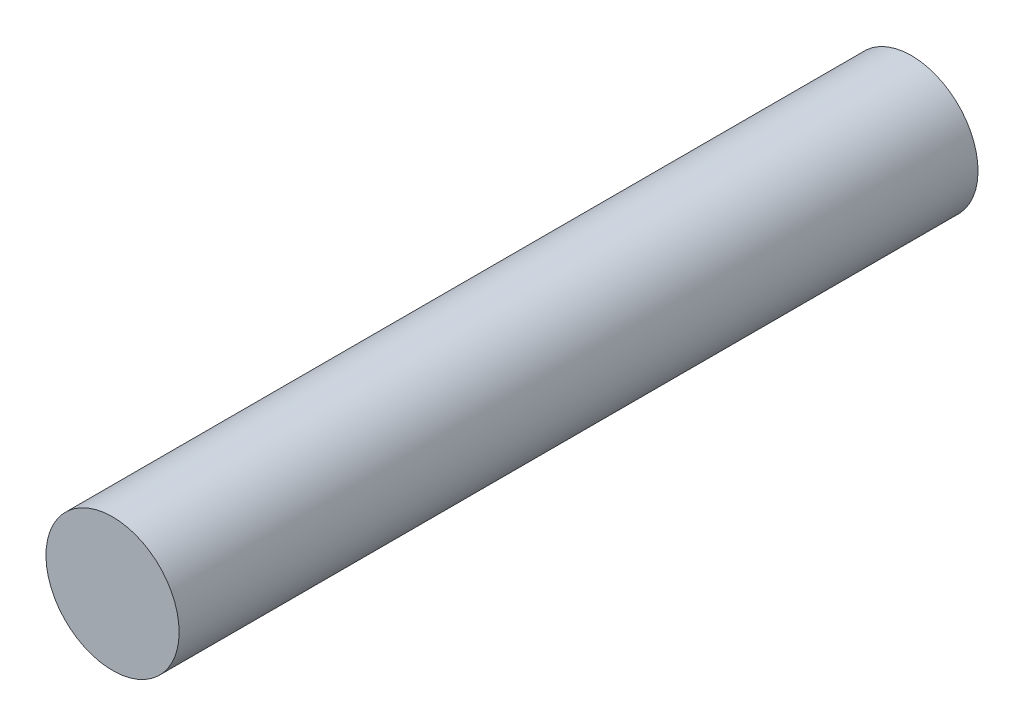
ISO-10303-21;
HEADER;
FILE_DESCRIPTION(('STEP AP214'),'2;1');
FILE_NAME('part.step','',(''),(''),'','','');
FILE_SCHEMA(('AUTOMOTIVE_DESIGN { 1 0 10303 214 1 1 1 1 }'));
ENDSEC;
DATA;
#1=APPLICATION_CONTEXT('core data for automotive mechanical design processes');
#2=APPLICATION_PROTOCOL_DEFINITION('international standard','automotive_design',2000,#1);
#3=PRODUCT_CONTEXT('',#1,'mechanical');
#4=PRODUCT('Part','Part','',(#3));
#5=PRODUCT_RELATED_PRODUCT_CATEGORY('part','',(#4));
#6=PRODUCT_DEFINITION_FORMATION('','',#4);
#7=PRODUCT_DEFINITION_CONTEXT('part definition',#1,'design');
#8=PRODUCT_DEFINITION('design','',#6,#7);
#9=PRODUCT_DEFINITION_SHAPE('','',#8);
#10=(LENGTH_UNIT() NAMED_UNIT(*) SI_UNIT(.MILLI.,.METRE.));
#11=(NAMED_UNIT(*) PLANE_ANGLE_UNIT() SI_UNIT($,.RADIAN.));
#12=(NAMED_UNIT(*) SI_UNIT($,.STERADIAN.) SOLID_ANGLE_UNIT());
#13=UNCERTAINTY_MEASURE_WITH_UNIT(LENGTH_MEASURE(1.E-05),#10,'distance_accuracy_value','');
#14=(GEOMETRIC_REPRESENTATION_CONTEXT(3) GLOBAL_UNCERTAINTY_ASSIGNED_CONTEXT((#13)) GLOBAL_UNIT_ASSIGNED_CONTEXT((#10,
#11,#12)) REPRESENTATION_CONTEXT('',''));
#15=CARTESIAN_POINT('',(0.,0.,0.));
#16=DIRECTION('',(0.,0.,1.));
#17=DIRECTION('',(1.,0.,0.));
#18=AXIS2_PLACEMENT_3D('',#15,#16,#17);
#19=CARTESIAN_POINT('',(0.,0.,15.));
#20=DIRECTION('',(0.,0.,-1.));
#21=DIRECTION('',(-1.,0.,0.));
#22=AXIS2_PLACEMENT_3D('',#19,#20,#21);
#23=CYLINDRICAL_SURFACE('',#22,2.5);
#24=CARTESIAN_POINT('',(0.,0.,15.));
#25=DIRECTION('',(0.,0.,1.));
#26=DIRECTION('',(1.,0.,0.));
#27=AXIS2_PLACEMENT_3D('',#24,#25,#26);
#28=CIRCLE('',#27,2.5);
#29=CARTESIAN_POINT('',(2.5,0.,15.));
#30=VERTEX_POINT('',#29);
#31=EDGE_CURVE('E13',#30,#30,#28,.T.);
#32=ORIENTED_EDGE('',*,*,#31,.F.);
#33=EDGE_LOOP('',(#32));
#34=FACE_BOUND('',#33,.T.);
#35=CARTESIAN_POINT('',(0.,1.06251812903579E-13,-5.));
#36=DIRECTION('',(0.,0.,-1.));
#37=DIRECTION('',(1.,0.,0.));
#38=AXIS2_PLACEMENT_3D('',#35,#36,#37);
#39=CIRCLE('',#38,2.5000000000001);
#40=CARTESIAN_POINT('',(0.5,-2.44948974278318,-5.));
#41=VERTEX_POINT('',#40);
#42=CARTESIAN_POINT('',(-0.5,-2.44948974278318,-5.));
#43=VERTEX_POINT('',#42);
#44=EDGE_CURVE('E108',#41,#43,#39,.T.);
#45=ORIENTED_EDGE('',*,*,#44,.F.);
#46=DIRECTION('',(0.,0.,-1.));
#47=VECTOR('',#46,1.);
#48=CARTESIAN_POINT('',(0.5,-2.44948974278318,-5.));
#49=LINE('',#48,#47);
#50=CARTESIAN_POINT('',(0.5,-2.44948974278318,-15.));
#51=VERTEX_POINT('',#50);
#52=EDGE_CURVE('E70',#41,#51,#49,.T.);
#53=ORIENTED_EDGE('',*,*,#52,.T.);
#54=CARTESIAN_POINT('',(0.,0.,-15.));
#55=DIRECTION('',(0.,0.,1.));
#56=DIRECTION('',(1.,0.,0.));
#57=AXIS2_PLACEMENT_3D('',#54,#55,#56);
#58=CIRCLE('',#57,2.5);
#59=CARTESIAN_POINT('',(-0.5,-2.44948974278318,-15.));
#60=VERTEX_POINT('',#59);
#61=EDGE_CURVE('E50',#51,#60,#58,.T.);
#62=ORIENTED_EDGE('',*,*,#61,.T.);
#63=DIRECTION('',(0.,0.,-1.));
#64=VECTOR('',#63,1.);
#65=CARTESIAN_POINT('',(-0.5,-2.44948974278318,-5.));
#66=LINE('',#65,#64);
#67=EDGE_CURVE('E61',#43,#60,#66,.T.);
#68=ORIENTED_EDGE('',*,*,#67,.F.);
#69=EDGE_LOOP('',(#45,#53,#62,#68));
#70=FACE_BOUND('',#69,.T.);
#71=ADVANCED_FACE('F47',(#34,#70),#23,.T.);
#72=CARTESIAN_POINT('',(0.,0.,15.));
#73=DIRECTION('',(0.,0.,1.));
#74=DIRECTION('',(1.,0.,0.));
#75=AXIS2_PLACEMENT_3D('',#72,#73,#74);
#76=PLANE('',#75);
#77=ORIENTED_EDGE('',*,*,#31,.T.);
#78=EDGE_LOOP('',(#77));
#79=FACE_BOUND('',#78,.T.);
#80=ADVANCED_FACE('F126',(#79),#76,.T.);
#81=CARTESIAN_POINT('',(0.,0.,-15.));
#82=DIRECTION('',(0.,0.,1.));
#83=DIRECTION('',(1.,0.,0.));
#84=AXIS2_PLACEMENT_3D('',#81,#82,#83);
#85=PLANE('',#84);
#86=ORIENTED_EDGE('',*,*,#61,.F.);
#87=DIRECTION('',(0.,-1.,0.));
#88=VECTOR('',#87,1.);
#89=CARTESIAN_POINT('',(0.5,-2.44948974278318,-15.));
#90=LINE('',#89,#88);
#91=CARTESIAN_POINT('',(0.5,-1.94948974278318,-15.));
#92=VERTEX_POINT('',#91);
#93=EDGE_CURVE('E85',#92,#51,#90,.T.);
#94=ORIENTED_EDGE('',*,*,#93,.F.);
#95=DIRECTION('',(1.,0.,0.));
#96=VECTOR('',#95,1.);
#97=CARTESIAN_POINT('',(0.5,-1.94948974278318,-15.));
#98=LINE('',#97,#96);
#99=CARTESIAN_POINT('',(-0.5,-1.94948974278318,-15.));
#100=VERTEX_POINT('',#99);
#101=EDGE_CURVE('E114',#100,#92,#98,.T.);
#102=ORIENTED_EDGE('',*,*,#101,.F.);
#103=DIRECTION('',(0.,1.,0.));
#104=VECTOR('',#103,1.);
#105=CARTESIAN_POINT('',(-0.5,-1.94948974278318,-15.));
#106=LINE('',#105,#104);
#107=EDGE_CURVE('E94',#60,#100,#106,.T.);
#108=ORIENTED_EDGE('',*,*,#107,.F.);
#109=EDGE_LOOP('',(#86,#94,#102,#108));
#110=FACE_BOUND('',#109,.T.);
#111=ADVANCED_FACE('F122',(#110),#85,.F.);
#112=CARTESIAN_POINT('',(0.5,-2.44948974278318,-5.));
#113=DIRECTION('',(1.,0.,0.));
#114=DIRECTION('',(0.,0.,-1.));
#115=AXIS2_PLACEMENT_3D('',#112,#113,#114);
#116=PLANE('',#115);
#117=ORIENTED_EDGE('',*,*,#93,.T.);
#118=ORIENTED_EDGE('',*,*,#52,.F.);
#119=DIRECTION('',(0.,-1.,0.));
#120=VECTOR('',#119,1.);
#121=CARTESIAN_POINT('',(0.5,-2.44948974278318,-5.));
#122=LINE('',#121,#120);
#123=CARTESIAN_POINT('',(0.5,-1.94948974278318,-5.));
#124=VERTEX_POINT('',#123);
#125=EDGE_CURVE('E104',#124,#41,#122,.T.);
#126=ORIENTED_EDGE('',*,*,#125,.F.);
#127=DIRECTION('',(0.,0.,-1.));
#128=VECTOR('',#127,1.);
#129=CARTESIAN_POINT('',(0.5,-1.94948974278318,-5.));
#130=LINE('',#129,#128);
#131=EDGE_CURVE('E98',#124,#92,#130,.T.);
#132=ORIENTED_EDGE('',*,*,#131,.T.);
#133=EDGE_LOOP('',(#117,#118,#126,#132));
#134=FACE_BOUND('',#133,.T.);
#135=ADVANCED_FACE('F119',(#134),#116,.F.);
#136=CARTESIAN_POINT('',(0.5,-1.94948974278318,-5.));
#137=DIRECTION('',(0.,1.,0.));
#138=DIRECTION('',(0.,0.,1.));
#139=AXIS2_PLACEMENT_3D('',#136,#137,#138);
#140=PLANE('',#139);
#141=ORIENTED_EDGE('',*,*,#101,.T.);
#142=ORIENTED_EDGE('',*,*,#131,.F.);
#143=DIRECTION('',(1.,0.,0.));
#144=VECTOR('',#143,1.);
#145=CARTESIAN_POINT('',(0.5,-1.94948974278318,-5.));
#146=LINE('',#145,#144);
#147=CARTESIAN_POINT('',(-0.5,-1.94948974278318,-5.));
#148=VERTEX_POINT('',#147);
#149=EDGE_CURVE('E101',#148,#124,#146,.T.);
#150=ORIENTED_EDGE('',*,*,#149,.F.);
#151=DIRECTION('',(0.,0.,-1.));
#152=VECTOR('',#151,1.);
#153=CARTESIAN_POINT('',(-0.5,-1.94948974278318,-5.));
#154=LINE('',#153,#152);
#155=EDGE_CURVE('E91',#148,#100,#154,.T.);
#156=ORIENTED_EDGE('',*,*,#155,.T.);
#157=EDGE_LOOP('',(#141,#142,#150,#156));
#158=FACE_BOUND('',#157,.T.);
#159=ADVANCED_FACE('F102',(#158),#140,.F.);
#160=CARTESIAN_POINT('',(-0.5,-1.94948974278318,-5.));
#161=DIRECTION('',(-1.,0.,0.));
#162=DIRECTION('',(0.,0.,1.));
#163=AXIS2_PLACEMENT_3D('',#160,#161,#162);
#164=PLANE('',#163);
#165=ORIENTED_EDGE('',*,*,#107,.T.);
#166=ORIENTED_EDGE('',*,*,#155,.F.);
#167=DIRECTION('',(0.,1.,0.));
#168=VECTOR('',#167,1.);
#169=CARTESIAN_POINT('',(-0.5,-1.94948974278318,-5.));
#170=LINE('',#169,#168);
#171=EDGE_CURVE('E89',#43,#148,#170,.T.);
#172=ORIENTED_EDGE('',*,*,#171,.F.);
#173=ORIENTED_EDGE('',*,*,#67,.T.);
#174=EDGE_LOOP('',(#165,#166,#172,#173));
#175=FACE_BOUND('',#174,.T.);
#176=ADVANCED_FACE('F93',(#175),#164,.F.);
#177=CARTESIAN_POINT('',(0.,1.06251812903579E-13,-5.));
#178=DIRECTION('',(0.,0.,1.));
#179=DIRECTION('',(1.,0.,0.));
#180=AXIS2_PLACEMENT_3D('',#177,#178,#179);
#181=PLANE('',#180);
#182=ORIENTED_EDGE('',*,*,#44,.T.);
#183=ORIENTED_EDGE('',*,*,#171,.T.);
#184=ORIENTED_EDGE('',*,*,#149,.T.);
#185=ORIENTED_EDGE('',*,*,#125,.T.);
#186=EDGE_LOOP('',(#182,#183,#184,#185));
#187=FACE_BOUND('',#186,.T.);
#188=ADVANCED_FACE('F106',(#187),#181,.F.);
#189=CLOSED_SHELL('',(#71,#80,#111,#135,#159,#176,#188));
#190=MANIFOLD_SOLID_BREP('B2',#189);
#191=ADVANCED_BREP_SHAPE_REPRESENTATION('',(#18,#190),#14);
#192=SHAPE_DEFINITION_REPRESENTATION(#9,#191);
ENDSEC;
END-ISO-10303-21;
